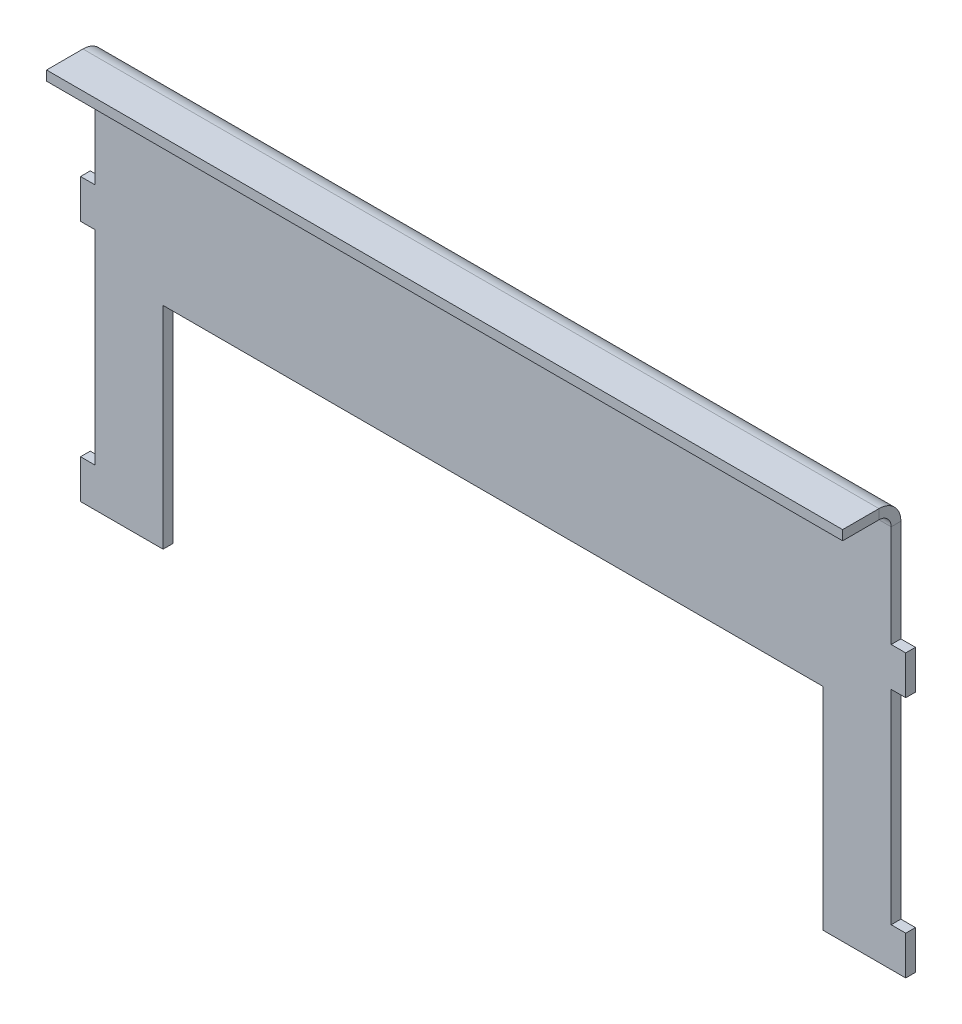
ISO-10303-21;
HEADER;
FILE_DESCRIPTION(('STEP AP214'),'2;1');
FILE_NAME('part.step','',(''),(''),'','','');
FILE_SCHEMA(('AUTOMOTIVE_DESIGN { 1 0 10303 214 1 1 1 1 }'));
ENDSEC;
DATA;
#1=APPLICATION_CONTEXT('core data for automotive mechanical design processes');
#2=APPLICATION_PROTOCOL_DEFINITION('international standard','automotive_design',2000,#1);
#3=PRODUCT_CONTEXT('',#1,'mechanical');
#4=PRODUCT('Part','Part','',(#3));
#5=PRODUCT_RELATED_PRODUCT_CATEGORY('part','',(#4));
#6=PRODUCT_DEFINITION_FORMATION('','',#4);
#7=PRODUCT_DEFINITION_CONTEXT('part definition',#1,'design');
#8=PRODUCT_DEFINITION('design','',#6,#7);
#9=PRODUCT_DEFINITION_SHAPE('','',#8);
#10=(LENGTH_UNIT() NAMED_UNIT(*) SI_UNIT(.MILLI.,.METRE.));
#11=(NAMED_UNIT(*) PLANE_ANGLE_UNIT() SI_UNIT($,.RADIAN.));
#12=(NAMED_UNIT(*) SI_UNIT($,.STERADIAN.) SOLID_ANGLE_UNIT());
#13=UNCERTAINTY_MEASURE_WITH_UNIT(LENGTH_MEASURE(1.E-05),#10,'distance_accuracy_value','');
#14=(GEOMETRIC_REPRESENTATION_CONTEXT(3) GLOBAL_UNCERTAINTY_ASSIGNED_CONTEXT((#13)) GLOBAL_UNIT_ASSIGNED_CONTEXT((#10,
#11,#12)) REPRESENTATION_CONTEXT('',''));
#15=CARTESIAN_POINT('',(0.,0.,0.));
#16=DIRECTION('',(0.,0.,1.));
#17=DIRECTION('',(1.,0.,0.));
#18=AXIS2_PLACEMENT_3D('',#15,#16,#17);
#19=CARTESIAN_POINT('',(-260.35,127.,-6.35));
#20=DIRECTION('',(-1.,0.,0.));
#21=DIRECTION('',(0.,0.,1.));
#22=AXIS2_PLACEMENT_3D('',#19,#20,#21);
#23=PLANE('',#22);
#24=DIRECTION('',(0.,-1.,0.));
#25=VECTOR('',#24,1.);
#26=CARTESIAN_POINT('',(-260.35,127.,0.));
#27=LINE('',#26,#25);
#28=CARTESIAN_POINT('',(-260.35,112.6998,0.));
#29=VERTEX_POINT('',#28);
#30=CARTESIAN_POINT('',(-260.35,46.0375,0.));
#31=VERTEX_POINT('',#30);
#32=EDGE_CURVE('E239',#29,#31,#27,.T.);
#33=ORIENTED_EDGE('',*,*,#32,.F.);
#34=DIRECTION('',(0.,0.,-1.));
#35=VECTOR('',#34,1.);
#36=CARTESIAN_POINT('',(-260.35,112.6998,0.));
#37=LINE('',#36,#35);
#38=CARTESIAN_POINT('',(-260.35,112.6998,-6.35));
#39=VERTEX_POINT('',#38);
#40=EDGE_CURVE('E350',#29,#39,#37,.T.);
#41=ORIENTED_EDGE('',*,*,#40,.T.);
#42=DIRECTION('',(0.,-1.,0.));
#43=VECTOR('',#42,1.);
#44=CARTESIAN_POINT('',(-260.35,127.,-6.35));
#45=LINE('',#44,#43);
#46=CARTESIAN_POINT('',(-260.35,46.0375,-6.35));
#47=VERTEX_POINT('',#46);
#48=EDGE_CURVE('E158',#39,#47,#45,.T.);
#49=ORIENTED_EDGE('',*,*,#48,.T.);
#50=DIRECTION('',(0.,0.,1.));
#51=VECTOR('',#50,1.);
#52=CARTESIAN_POINT('',(-260.35,46.0375,-6.35));
#53=LINE('',#52,#51);
#54=EDGE_CURVE('E68',#47,#31,#53,.T.);
#55=ORIENTED_EDGE('',*,*,#54,.T.);
#56=EDGE_LOOP('',(#33,#41,#49,#55));
#57=FACE_BOUND('',#56,.T.);
#58=ADVANCED_FACE('F65',(#57),#23,.T.);
#59=CARTESIAN_POINT('',(0.,0.,-6.35));
#60=DIRECTION('',(0.,0.,-1.));
#61=DIRECTION('',(-1.,0.,0.));
#62=AXIS2_PLACEMENT_3D('',#59,#60,#61);
#63=PLANE('',#62);
#64=ORIENTED_EDGE('',*,*,#48,.F.);
#65=DIRECTION('',(-1.,0.,0.));
#66=VECTOR('',#65,1.);
#67=CARTESIAN_POINT('',(-260.35,112.6998,-6.35));
#68=LINE('',#67,#66);
#69=CARTESIAN_POINT('',(260.35,112.6998,-6.35));
#70=VERTEX_POINT('',#69);
#71=EDGE_CURVE('E791',#39,#70,#68,.F.);
#72=ORIENTED_EDGE('',*,*,#71,.T.);
#73=DIRECTION('',(0.,1.,0.));
#74=VECTOR('',#73,1.);
#75=CARTESIAN_POINT('',(260.35,127.,-6.35));
#76=LINE('',#75,#74);
#77=CARTESIAN_POINT('',(260.35,46.0375,-6.35));
#78=VERTEX_POINT('',#77);
#79=EDGE_CURVE('E237',#78,#70,#76,.T.);
#80=ORIENTED_EDGE('',*,*,#79,.F.);
#81=DIRECTION('',(-1.,0.,0.));
#82=VECTOR('',#81,1.);
#83=CARTESIAN_POINT('',(260.35,46.0375,-6.35));
#84=LINE('',#83,#82);
#85=CARTESIAN_POINT('',(269.875,46.0375,-6.35));
#86=VERTEX_POINT('',#85);
#87=EDGE_CURVE('E227',#86,#78,#84,.T.);
#88=ORIENTED_EDGE('',*,*,#87,.F.);
#89=DIRECTION('',(0.,1.,0.));
#90=VECTOR('',#89,1.);
#91=CARTESIAN_POINT('',(269.875,46.0375,-6.35));
#92=LINE('',#91,#90);
#93=CARTESIAN_POINT('',(269.875,20.6375,-6.35));
#94=VERTEX_POINT('',#93);
#95=EDGE_CURVE('E211',#94,#86,#92,.T.);
#96=ORIENTED_EDGE('',*,*,#95,.F.);
#97=DIRECTION('',(1.,0.,0.));
#98=VECTOR('',#97,1.);
#99=CARTESIAN_POINT('',(260.35,20.6375,-6.35));
#100=LINE('',#99,#98);
#101=CARTESIAN_POINT('',(260.35,20.6375,-6.35));
#102=VERTEX_POINT('',#101);
#103=EDGE_CURVE('E225',#102,#94,#100,.T.);
#104=ORIENTED_EDGE('',*,*,#103,.F.);
#105=DIRECTION('',(0.,1.,0.));
#106=VECTOR('',#105,1.);
#107=CARTESIAN_POINT('',(260.35,20.6375,-6.35));
#108=LINE('',#107,#106);
#109=CARTESIAN_POINT('',(260.35,-112.7125,-6.35));
#110=VERTEX_POINT('',#109);
#111=EDGE_CURVE('E230',#110,#102,#108,.T.);
#112=ORIENTED_EDGE('',*,*,#111,.F.);
#113=DIRECTION('',(-1.,0.,0.));
#114=VECTOR('',#113,1.);
#115=CARTESIAN_POINT('',(260.35,-112.7125,-6.35));
#116=LINE('',#115,#114);
#117=CARTESIAN_POINT('',(269.875,-112.7125,-6.35));
#118=VERTEX_POINT('',#117);
#119=EDGE_CURVE('E232',#118,#110,#116,.T.);
#120=ORIENTED_EDGE('',*,*,#119,.F.);
#121=DIRECTION('',(0.,1.,0.));
#122=VECTOR('',#121,1.);
#123=CARTESIAN_POINT('',(269.875,-138.1125,-6.35));
#124=LINE('',#123,#122);
#125=CARTESIAN_POINT('',(269.875,-138.1125,-6.35));
#126=VERTEX_POINT('',#125);
#127=EDGE_CURVE('E385',#126,#118,#124,.T.);
#128=ORIENTED_EDGE('',*,*,#127,.F.);
#129=DIRECTION('',(1.,0.,0.));
#130=VECTOR('',#129,1.);
#131=CARTESIAN_POINT('',(269.875,-138.1125,-6.35));
#132=LINE('',#131,#130);
#133=CARTESIAN_POINT('',(215.9,-138.1125,-6.35));
#134=VERTEX_POINT('',#133);
#135=EDGE_CURVE('E382',#134,#126,#132,.T.);
#136=ORIENTED_EDGE('',*,*,#135,.F.);
#137=DIRECTION('',(0.,-1.,0.));
#138=VECTOR('',#137,1.);
#139=CARTESIAN_POINT('',(215.9,0.,-6.35));
#140=LINE('',#139,#138);
#141=CARTESIAN_POINT('',(215.9,0.,-6.35));
#142=VERTEX_POINT('',#141);
#143=EDGE_CURVE('E379',#142,#134,#140,.T.);
#144=ORIENTED_EDGE('',*,*,#143,.F.);
#145=DIRECTION('',(1.,0.,0.));
#146=VECTOR('',#145,1.);
#147=CARTESIAN_POINT('',(-215.9,0.,-6.35));
#148=LINE('',#147,#146);
#149=CARTESIAN_POINT('',(-215.9,0.,-6.35));
#150=VERTEX_POINT('',#149);
#151=EDGE_CURVE('E376',#150,#142,#148,.T.);
#152=ORIENTED_EDGE('',*,*,#151,.F.);
#153=DIRECTION('',(0.,1.,0.));
#154=VECTOR('',#153,1.);
#155=CARTESIAN_POINT('',(-215.9,0.,-6.35));
#156=LINE('',#155,#154);
#157=CARTESIAN_POINT('',(-215.9,-138.1125,-6.35));
#158=VERTEX_POINT('',#157);
#159=EDGE_CURVE('E373',#158,#150,#156,.T.);
#160=ORIENTED_EDGE('',*,*,#159,.F.);
#161=DIRECTION('',(1.,0.,0.));
#162=VECTOR('',#161,1.);
#163=CARTESIAN_POINT('',(-269.875,-138.1125,-6.35));
#164=LINE('',#163,#162);
#165=CARTESIAN_POINT('',(-269.875,-138.1125,-6.35));
#166=VERTEX_POINT('',#165);
#167=EDGE_CURVE('E370',#166,#158,#164,.T.);
#168=ORIENTED_EDGE('',*,*,#167,.F.);
#169=DIRECTION('',(0.,-1.,0.));
#170=VECTOR('',#169,1.);
#171=CARTESIAN_POINT('',(-269.875,-138.1125,-6.35));
#172=LINE('',#171,#170);
#173=CARTESIAN_POINT('',(-269.875,-112.7125,-6.35));
#174=VERTEX_POINT('',#173);
#175=EDGE_CURVE('E367',#174,#166,#172,.T.);
#176=ORIENTED_EDGE('',*,*,#175,.F.);
#177=DIRECTION('',(-1.,0.,0.));
#178=VECTOR('',#177,1.);
#179=CARTESIAN_POINT('',(-260.35,-112.7125,-6.35));
#180=LINE('',#179,#178);
#181=CARTESIAN_POINT('',(-260.35,-112.7125,-6.35));
#182=VERTEX_POINT('',#181);
#183=EDGE_CURVE('E364',#182,#174,#180,.T.);
#184=ORIENTED_EDGE('',*,*,#183,.F.);
#185=DIRECTION('',(0.,-1.,0.));
#186=VECTOR('',#185,1.);
#187=CARTESIAN_POINT('',(-260.35,20.6375,-6.35));
#188=LINE('',#187,#186);
#189=CARTESIAN_POINT('',(-260.35,20.6375,-6.35));
#190=VERTEX_POINT('',#189);
#191=EDGE_CURVE('E361',#190,#182,#188,.T.);
#192=ORIENTED_EDGE('',*,*,#191,.F.);
#193=DIRECTION('',(1.,0.,0.));
#194=VECTOR('',#193,1.);
#195=CARTESIAN_POINT('',(-260.35,20.6375,-6.35));
#196=LINE('',#195,#194);
#197=CARTESIAN_POINT('',(-269.875,20.6375,-6.35));
#198=VERTEX_POINT('',#197);
#199=EDGE_CURVE('E358',#198,#190,#196,.T.);
#200=ORIENTED_EDGE('',*,*,#199,.F.);
#201=DIRECTION('',(0.,-1.,0.));
#202=VECTOR('',#201,1.);
#203=CARTESIAN_POINT('',(-269.875,46.0375,-6.35));
#204=LINE('',#203,#202);
#205=CARTESIAN_POINT('',(-269.875,46.0375,-6.35));
#206=VERTEX_POINT('',#205);
#207=EDGE_CURVE('E355',#206,#198,#204,.T.);
#208=ORIENTED_EDGE('',*,*,#207,.F.);
#209=DIRECTION('',(-1.,0.,0.));
#210=VECTOR('',#209,1.);
#211=CARTESIAN_POINT('',(-260.35,46.0375,-6.35));
#212=LINE('',#211,#210);
#213=EDGE_CURVE('E353',#47,#206,#212,.T.);
#214=ORIENTED_EDGE('',*,*,#213,.F.);
#215=EDGE_LOOP('',(#64,#72,#80,#88,#96,#104,#112,#120,#128,#136,#144,#152,#160,#168,#176,#184,
#192,#200,#208,#214));
#216=FACE_BOUND('',#215,.T.);
#217=ADVANCED_FACE('F223',(#216),#63,.T.);
#218=CARTESIAN_POINT('',(0.,0.,0.));
#219=DIRECTION('',(0.,0.,-1.));
#220=DIRECTION('',(-1.,0.,0.));
#221=AXIS2_PLACEMENT_3D('',#218,#219,#220);
#222=PLANE('',#221);
#223=DIRECTION('',(-1.,0.,0.));
#224=VECTOR('',#223,1.);
#225=CARTESIAN_POINT('',(-260.35,112.6998,0.));
#226=LINE('',#225,#224);
#227=CARTESIAN_POINT('',(260.35,112.6998,0.));
#228=VERTEX_POINT('',#227);
#229=EDGE_CURVE('E331',#29,#228,#226,.F.);
#230=ORIENTED_EDGE('',*,*,#229,.F.);
#231=ORIENTED_EDGE('',*,*,#32,.T.);
#232=DIRECTION('',(-1.,0.,0.));
#233=VECTOR('',#232,1.);
#234=CARTESIAN_POINT('',(-260.35,46.0375,0.));
#235=LINE('',#234,#233);
#236=CARTESIAN_POINT('',(-269.875,46.0375,0.));
#237=VERTEX_POINT('',#236);
#238=EDGE_CURVE('E241',#31,#237,#235,.T.);
#239=ORIENTED_EDGE('',*,*,#238,.T.);
#240=DIRECTION('',(0.,-1.,0.));
#241=VECTOR('',#240,1.);
#242=CARTESIAN_POINT('',(-269.875,46.0375,0.));
#243=LINE('',#242,#241);
#244=CARTESIAN_POINT('',(-269.875,20.6375,0.));
#245=VERTEX_POINT('',#244);
#246=EDGE_CURVE('E245',#237,#245,#243,.T.);
#247=ORIENTED_EDGE('',*,*,#246,.T.);
#248=DIRECTION('',(1.,0.,0.));
#249=VECTOR('',#248,1.);
#250=CARTESIAN_POINT('',(-260.35,20.6375,0.));
#251=LINE('',#250,#249);
#252=CARTESIAN_POINT('',(-260.35,20.6375,0.));
#253=VERTEX_POINT('',#252);
#254=EDGE_CURVE('E248',#245,#253,#251,.T.);
#255=ORIENTED_EDGE('',*,*,#254,.T.);
#256=DIRECTION('',(0.,-1.,0.));
#257=VECTOR('',#256,1.);
#258=CARTESIAN_POINT('',(-260.35,20.6375,0.));
#259=LINE('',#258,#257);
#260=CARTESIAN_POINT('',(-260.35,-112.7125,0.));
#261=VERTEX_POINT('',#260);
#262=EDGE_CURVE('E251',#253,#261,#259,.T.);
#263=ORIENTED_EDGE('',*,*,#262,.T.);
#264=DIRECTION('',(-1.,0.,0.));
#265=VECTOR('',#264,1.);
#266=CARTESIAN_POINT('',(-260.35,-112.7125,0.));
#267=LINE('',#266,#265);
#268=CARTESIAN_POINT('',(-269.875,-112.7125,0.));
#269=VERTEX_POINT('',#268);
#270=EDGE_CURVE('E254',#261,#269,#267,.T.);
#271=ORIENTED_EDGE('',*,*,#270,.T.);
#272=DIRECTION('',(0.,-1.,0.));
#273=VECTOR('',#272,1.);
#274=CARTESIAN_POINT('',(-269.875,-138.1125,0.));
#275=LINE('',#274,#273);
#276=CARTESIAN_POINT('',(-269.875,-138.1125,0.));
#277=VERTEX_POINT('',#276);
#278=EDGE_CURVE('E257',#269,#277,#275,.T.);
#279=ORIENTED_EDGE('',*,*,#278,.T.);
#280=DIRECTION('',(1.,0.,0.));
#281=VECTOR('',#280,1.);
#282=CARTESIAN_POINT('',(-269.875,-138.1125,0.));
#283=LINE('',#282,#281);
#284=CARTESIAN_POINT('',(-215.9,-138.1125,0.));
#285=VERTEX_POINT('',#284);
#286=EDGE_CURVE('E260',#277,#285,#283,.T.);
#287=ORIENTED_EDGE('',*,*,#286,.T.);
#288=DIRECTION('',(0.,1.,0.));
#289=VECTOR('',#288,1.);
#290=CARTESIAN_POINT('',(-215.9,0.,0.));
#291=LINE('',#290,#289);
#292=CARTESIAN_POINT('',(-215.9,0.,0.));
#293=VERTEX_POINT('',#292);
#294=EDGE_CURVE('E263',#285,#293,#291,.T.);
#295=ORIENTED_EDGE('',*,*,#294,.T.);
#296=DIRECTION('',(1.,0.,0.));
#297=VECTOR('',#296,1.);
#298=CARTESIAN_POINT('',(-215.9,0.,0.));
#299=LINE('',#298,#297);
#300=CARTESIAN_POINT('',(215.9,0.,0.));
#301=VERTEX_POINT('',#300);
#302=EDGE_CURVE('E266',#293,#301,#299,.T.);
#303=ORIENTED_EDGE('',*,*,#302,.T.);
#304=DIRECTION('',(0.,-1.,0.));
#305=VECTOR('',#304,1.);
#306=CARTESIAN_POINT('',(215.9,0.,0.));
#307=LINE('',#306,#305);
#308=CARTESIAN_POINT('',(215.9,-138.1125,0.));
#309=VERTEX_POINT('',#308);
#310=EDGE_CURVE('E269',#301,#309,#307,.T.);
#311=ORIENTED_EDGE('',*,*,#310,.T.);
#312=DIRECTION('',(1.,0.,0.));
#313=VECTOR('',#312,1.);
#314=CARTESIAN_POINT('',(269.875,-138.1125,0.));
#315=LINE('',#314,#313);
#316=CARTESIAN_POINT('',(269.875,-138.1125,0.));
#317=VERTEX_POINT('',#316);
#318=EDGE_CURVE('E272',#309,#317,#315,.T.);
#319=ORIENTED_EDGE('',*,*,#318,.T.);
#320=DIRECTION('',(0.,1.,0.));
#321=VECTOR('',#320,1.);
#322=CARTESIAN_POINT('',(269.875,-138.1125,0.));
#323=LINE('',#322,#321);
#324=CARTESIAN_POINT('',(269.875,-112.7125,0.));
#325=VERTEX_POINT('',#324);
#326=EDGE_CURVE('E275',#317,#325,#323,.T.);
#327=ORIENTED_EDGE('',*,*,#326,.T.);
#328=DIRECTION('',(-1.,0.,0.));
#329=VECTOR('',#328,1.);
#330=CARTESIAN_POINT('',(260.35,-112.7125,0.));
#331=LINE('',#330,#329);
#332=CARTESIAN_POINT('',(260.35,-112.7125,0.));
#333=VERTEX_POINT('',#332);
#334=EDGE_CURVE('E278',#325,#333,#331,.T.);
#335=ORIENTED_EDGE('',*,*,#334,.T.);
#336=DIRECTION('',(0.,1.,0.));
#337=VECTOR('',#336,1.);
#338=CARTESIAN_POINT('',(260.35,20.6375,0.));
#339=LINE('',#338,#337);
#340=CARTESIAN_POINT('',(260.35,20.6375,0.));
#341=VERTEX_POINT('',#340);
#342=EDGE_CURVE('E281',#333,#341,#339,.T.);
#343=ORIENTED_EDGE('',*,*,#342,.T.);
#344=DIRECTION('',(1.,0.,0.));
#345=VECTOR('',#344,1.);
#346=CARTESIAN_POINT('',(260.35,20.6375,0.));
#347=LINE('',#346,#345);
#348=CARTESIAN_POINT('',(269.875,20.6375,0.));
#349=VERTEX_POINT('',#348);
#350=EDGE_CURVE('E284',#341,#349,#347,.T.);
#351=ORIENTED_EDGE('',*,*,#350,.T.);
#352=DIRECTION('',(0.,1.,0.));
#353=VECTOR('',#352,1.);
#354=CARTESIAN_POINT('',(269.875,46.0375,0.));
#355=LINE('',#354,#353);
#356=CARTESIAN_POINT('',(269.875,46.0375,0.));
#357=VERTEX_POINT('',#356);
#358=EDGE_CURVE('E213',#349,#357,#355,.T.);
#359=ORIENTED_EDGE('',*,*,#358,.T.);
#360=DIRECTION('',(-1.,0.,0.));
#361=VECTOR('',#360,1.);
#362=CARTESIAN_POINT('',(260.35,46.0375,0.));
#363=LINE('',#362,#361);
#364=CARTESIAN_POINT('',(260.35,46.0375,0.));
#365=VERTEX_POINT('',#364);
#366=EDGE_CURVE('E287',#357,#365,#363,.T.);
#367=ORIENTED_EDGE('',*,*,#366,.T.);
#368=DIRECTION('',(0.,1.,0.));
#369=VECTOR('',#368,1.);
#370=CARTESIAN_POINT('',(260.35,127.,0.));
#371=LINE('',#370,#369);
#372=EDGE_CURVE('E290',#365,#228,#371,.T.);
#373=ORIENTED_EDGE('',*,*,#372,.T.);
#374=EDGE_LOOP('',(#230,#231,#239,#247,#255,#263,#271,#279,#287,#295,#303,#311,#319,#327,#335,
#343,#351,#359,#367,#373));
#375=FACE_BOUND('',#374,.T.);
#376=ADVANCED_FACE('F329',(#375),#222,.F.);
#377=CARTESIAN_POINT('',(260.35,127.,-6.35));
#378=DIRECTION('',(1.,0.,0.));
#379=DIRECTION('',(0.,0.,-1.));
#380=AXIS2_PLACEMENT_3D('',#377,#378,#379);
#381=PLANE('',#380);
#382=DIRECTION('',(0.,0.,-1.));
#383=VECTOR('',#382,1.);
#384=CARTESIAN_POINT('',(260.35,112.6998,0.));
#385=LINE('',#384,#383);
#386=EDGE_CURVE('E242',#228,#70,#385,.T.);
#387=ORIENTED_EDGE('',*,*,#386,.F.);
#388=ORIENTED_EDGE('',*,*,#372,.F.);
#389=DIRECTION('',(0.,0.,1.));
#390=VECTOR('',#389,1.);
#391=CARTESIAN_POINT('',(260.35,46.0375,-6.35));
#392=LINE('',#391,#390);
#393=EDGE_CURVE('E13',#78,#365,#392,.T.);
#394=ORIENTED_EDGE('',*,*,#393,.F.);
#395=ORIENTED_EDGE('',*,*,#79,.T.);
#396=EDGE_LOOP('',(#387,#388,#394,#395));
#397=FACE_BOUND('',#396,.T.);
#398=ADVANCED_FACE('F452',(#397),#381,.T.);
#399=CARTESIAN_POINT('',(260.35,46.0375,-6.35));
#400=DIRECTION('',(0.,1.,0.));
#401=DIRECTION('',(0.,0.,1.));
#402=AXIS2_PLACEMENT_3D('',#399,#400,#401);
#403=PLANE('',#402);
#404=ORIENTED_EDGE('',*,*,#366,.F.);
#405=DIRECTION('',(0.,0.,1.));
#406=VECTOR('',#405,1.);
#407=CARTESIAN_POINT('',(269.875,46.0375,-6.35));
#408=LINE('',#407,#406);
#409=EDGE_CURVE('E73',#86,#357,#408,.T.);
#410=ORIENTED_EDGE('',*,*,#409,.F.);
#411=ORIENTED_EDGE('',*,*,#87,.T.);
#412=ORIENTED_EDGE('',*,*,#393,.T.);
#413=EDGE_LOOP('',(#404,#410,#411,#412));
#414=FACE_BOUND('',#413,.T.);
#415=ADVANCED_FACE('F460',(#414),#403,.T.);
#416=CARTESIAN_POINT('',(269.875,46.0375,-6.35));
#417=DIRECTION('',(1.,0.,0.));
#418=DIRECTION('',(0.,0.,-1.));
#419=AXIS2_PLACEMENT_3D('',#416,#417,#418);
#420=PLANE('',#419);
#421=ORIENTED_EDGE('',*,*,#358,.F.);
#422=DIRECTION('',(0.,0.,1.));
#423=VECTOR('',#422,1.);
#424=CARTESIAN_POINT('',(269.875,20.6375,-6.35));
#425=LINE('',#424,#423);
#426=EDGE_CURVE('E208',#94,#349,#425,.T.);
#427=ORIENTED_EDGE('',*,*,#426,.F.);
#428=ORIENTED_EDGE('',*,*,#95,.T.);
#429=ORIENTED_EDGE('',*,*,#409,.T.);
#430=EDGE_LOOP('',(#421,#427,#428,#429));
#431=FACE_BOUND('',#430,.T.);
#432=ADVANCED_FACE('F210',(#431),#420,.T.);
#433=CARTESIAN_POINT('',(260.35,20.6375,-6.35));
#434=DIRECTION('',(0.,-1.,0.));
#435=DIRECTION('',(0.,0.,-1.));
#436=AXIS2_PLACEMENT_3D('',#433,#434,#435);
#437=PLANE('',#436);
#438=ORIENTED_EDGE('',*,*,#350,.F.);
#439=DIRECTION('',(0.,0.,1.));
#440=VECTOR('',#439,1.);
#441=CARTESIAN_POINT('',(260.35,20.6375,-6.35));
#442=LINE('',#441,#440);
#443=EDGE_CURVE('E218',#102,#341,#442,.T.);
#444=ORIENTED_EDGE('',*,*,#443,.F.);
#445=ORIENTED_EDGE('',*,*,#103,.T.);
#446=ORIENTED_EDGE('',*,*,#426,.T.);
#447=EDGE_LOOP('',(#438,#444,#445,#446));
#448=FACE_BOUND('',#447,.T.);
#449=ADVANCED_FACE('F229',(#448),#437,.T.);
#450=CARTESIAN_POINT('',(260.35,20.6375,-6.35));
#451=DIRECTION('',(1.,0.,0.));
#452=DIRECTION('',(0.,0.,-1.));
#453=AXIS2_PLACEMENT_3D('',#450,#451,#452);
#454=PLANE('',#453);
#455=ORIENTED_EDGE('',*,*,#342,.F.);
#456=DIRECTION('',(0.,0.,1.));
#457=VECTOR('',#456,1.);
#458=CARTESIAN_POINT('',(260.35,-112.7125,-6.35));
#459=LINE('',#458,#457);
#460=EDGE_CURVE('E295',#110,#333,#459,.T.);
#461=ORIENTED_EDGE('',*,*,#460,.F.);
#462=ORIENTED_EDGE('',*,*,#111,.T.);
#463=ORIENTED_EDGE('',*,*,#443,.T.);
#464=EDGE_LOOP('',(#455,#461,#462,#463));
#465=FACE_BOUND('',#464,.T.);
#466=ADVANCED_FACE('F467',(#465),#454,.T.);
#467=CARTESIAN_POINT('',(260.35,-112.7125,-6.35));
#468=DIRECTION('',(0.,1.,0.));
#469=DIRECTION('',(0.,0.,1.));
#470=AXIS2_PLACEMENT_3D('',#467,#468,#469);
#471=PLANE('',#470);
#472=ORIENTED_EDGE('',*,*,#334,.F.);
#473=DIRECTION('',(0.,0.,1.));
#474=VECTOR('',#473,1.);
#475=CARTESIAN_POINT('',(269.875,-112.7125,-6.35));
#476=LINE('',#475,#474);
#477=EDGE_CURVE('E297',#118,#325,#476,.T.);
#478=ORIENTED_EDGE('',*,*,#477,.F.);
#479=ORIENTED_EDGE('',*,*,#119,.T.);
#480=ORIENTED_EDGE('',*,*,#460,.T.);
#481=EDGE_LOOP('',(#472,#478,#479,#480));
#482=FACE_BOUND('',#481,.T.);
#483=ADVANCED_FACE('F391',(#482),#471,.T.);
#484=CARTESIAN_POINT('',(269.875,-138.1125,-6.35));
#485=DIRECTION('',(1.,0.,0.));
#486=DIRECTION('',(0.,0.,-1.));
#487=AXIS2_PLACEMENT_3D('',#484,#485,#486);
#488=PLANE('',#487);
#489=ORIENTED_EDGE('',*,*,#326,.F.);
#490=DIRECTION('',(0.,0.,1.));
#491=VECTOR('',#490,1.);
#492=CARTESIAN_POINT('',(269.875,-138.1125,-6.35));
#493=LINE('',#492,#491);
#494=EDGE_CURVE('E299',#126,#317,#493,.T.);
#495=ORIENTED_EDGE('',*,*,#494,.F.);
#496=ORIENTED_EDGE('',*,*,#127,.T.);
#497=ORIENTED_EDGE('',*,*,#477,.T.);
#498=EDGE_LOOP('',(#489,#495,#496,#497));
#499=FACE_BOUND('',#498,.T.);
#500=ADVANCED_FACE('F397',(#499),#488,.T.);
#501=CARTESIAN_POINT('',(269.875,-138.1125,-6.35));
#502=DIRECTION('',(0.,-1.,0.));
#503=DIRECTION('',(0.,0.,-1.));
#504=AXIS2_PLACEMENT_3D('',#501,#502,#503);
#505=PLANE('',#504);
#506=ORIENTED_EDGE('',*,*,#318,.F.);
#507=DIRECTION('',(0.,0.,1.));
#508=VECTOR('',#507,1.);
#509=CARTESIAN_POINT('',(215.9,-138.1125,-6.35));
#510=LINE('',#509,#508);
#511=EDGE_CURVE('E301',#134,#309,#510,.T.);
#512=ORIENTED_EDGE('',*,*,#511,.F.);
#513=ORIENTED_EDGE('',*,*,#135,.T.);
#514=ORIENTED_EDGE('',*,*,#494,.T.);
#515=EDGE_LOOP('',(#506,#512,#513,#514));
#516=FACE_BOUND('',#515,.T.);
#517=ADVANCED_FACE('F400',(#516),#505,.T.);
#518=CARTESIAN_POINT('',(215.9,0.,-6.35));
#519=DIRECTION('',(-1.,0.,0.));
#520=DIRECTION('',(0.,-1.,0.));
#521=AXIS2_PLACEMENT_3D('',#518,#519,#520);
#522=PLANE('',#521);
#523=ORIENTED_EDGE('',*,*,#310,.F.);
#524=DIRECTION('',(0.,0.,1.));
#525=VECTOR('',#524,1.);
#526=CARTESIAN_POINT('',(215.9,0.,-6.35));
#527=LINE('',#526,#525);
#528=EDGE_CURVE('E303',#142,#301,#527,.T.);
#529=ORIENTED_EDGE('',*,*,#528,.F.);
#530=ORIENTED_EDGE('',*,*,#143,.T.);
#531=ORIENTED_EDGE('',*,*,#511,.T.);
#532=EDGE_LOOP('',(#523,#529,#530,#531));
#533=FACE_BOUND('',#532,.T.);
#534=ADVANCED_FACE('F405',(#533),#522,.T.);
#535=CARTESIAN_POINT('',(-215.9,0.,-6.35));
#536=DIRECTION('',(0.,-1.,0.));
#537=DIRECTION('',(0.,0.,-1.));
#538=AXIS2_PLACEMENT_3D('',#535,#536,#537);
#539=PLANE('',#538);
#540=ORIENTED_EDGE('',*,*,#302,.F.);
#541=DIRECTION('',(0.,0.,1.));
#542=VECTOR('',#541,1.);
#543=CARTESIAN_POINT('',(-215.9,0.,-6.35));
#544=LINE('',#543,#542);
#545=EDGE_CURVE('E305',#150,#293,#544,.T.);
#546=ORIENTED_EDGE('',*,*,#545,.F.);
#547=ORIENTED_EDGE('',*,*,#151,.T.);
#548=ORIENTED_EDGE('',*,*,#528,.T.);
#549=EDGE_LOOP('',(#540,#546,#547,#548));
#550=FACE_BOUND('',#549,.T.);
#551=ADVANCED_FACE('F408',(#550),#539,.T.);
#552=CARTESIAN_POINT('',(-215.9,0.,-6.35));
#553=DIRECTION('',(1.,0.,0.));
#554=DIRECTION('',(0.,1.,0.));
#555=AXIS2_PLACEMENT_3D('',#552,#553,#554);
#556=PLANE('',#555);
#557=ORIENTED_EDGE('',*,*,#294,.F.);
#558=DIRECTION('',(0.,0.,1.));
#559=VECTOR('',#558,1.);
#560=CARTESIAN_POINT('',(-215.9,-138.1125,-6.35));
#561=LINE('',#560,#559);
#562=EDGE_CURVE('E307',#158,#285,#561,.T.);
#563=ORIENTED_EDGE('',*,*,#562,.F.);
#564=ORIENTED_EDGE('',*,*,#159,.T.);
#565=ORIENTED_EDGE('',*,*,#545,.T.);
#566=EDGE_LOOP('',(#557,#563,#564,#565));
#567=FACE_BOUND('',#566,.T.);
#568=ADVANCED_FACE('F413',(#567),#556,.T.);
#569=CARTESIAN_POINT('',(-269.875,-138.1125,-6.35));
#570=DIRECTION('',(0.,-1.,0.));
#571=DIRECTION('',(0.,0.,-1.));
#572=AXIS2_PLACEMENT_3D('',#569,#570,#571);
#573=PLANE('',#572);
#574=ORIENTED_EDGE('',*,*,#286,.F.);
#575=DIRECTION('',(0.,0.,1.));
#576=VECTOR('',#575,1.);
#577=CARTESIAN_POINT('',(-269.875,-138.1125,-6.35));
#578=LINE('',#577,#576);
#579=EDGE_CURVE('E309',#166,#277,#578,.T.);
#580=ORIENTED_EDGE('',*,*,#579,.F.);
#581=ORIENTED_EDGE('',*,*,#167,.T.);
#582=ORIENTED_EDGE('',*,*,#562,.T.);
#583=EDGE_LOOP('',(#574,#580,#581,#582));
#584=FACE_BOUND('',#583,.T.);
#585=ADVANCED_FACE('F416',(#584),#573,.T.);
#586=CARTESIAN_POINT('',(-269.875,-138.1125,-6.35));
#587=DIRECTION('',(-1.,0.,0.));
#588=DIRECTION('',(0.,0.,1.));
#589=AXIS2_PLACEMENT_3D('',#586,#587,#588);
#590=PLANE('',#589);
#591=ORIENTED_EDGE('',*,*,#278,.F.);
#592=DIRECTION('',(0.,0.,1.));
#593=VECTOR('',#592,1.);
#594=CARTESIAN_POINT('',(-269.875,-112.7125,-6.35));
#595=LINE('',#594,#593);
#596=EDGE_CURVE('E311',#174,#269,#595,.T.);
#597=ORIENTED_EDGE('',*,*,#596,.F.);
#598=ORIENTED_EDGE('',*,*,#175,.T.);
#599=ORIENTED_EDGE('',*,*,#579,.T.);
#600=EDGE_LOOP('',(#591,#597,#598,#599));
#601=FACE_BOUND('',#600,.T.);
#602=ADVANCED_FACE('F421',(#601),#590,.T.);
#603=CARTESIAN_POINT('',(-260.35,-112.7125,-6.35));
#604=DIRECTION('',(0.,1.,0.));
#605=DIRECTION('',(0.,0.,1.));
#606=AXIS2_PLACEMENT_3D('',#603,#604,#605);
#607=PLANE('',#606);
#608=ORIENTED_EDGE('',*,*,#270,.F.);
#609=DIRECTION('',(0.,0.,1.));
#610=VECTOR('',#609,1.);
#611=CARTESIAN_POINT('',(-260.35,-112.7125,-6.35));
#612=LINE('',#611,#610);
#613=EDGE_CURVE('E313',#182,#261,#612,.T.);
#614=ORIENTED_EDGE('',*,*,#613,.F.);
#615=ORIENTED_EDGE('',*,*,#183,.T.);
#616=ORIENTED_EDGE('',*,*,#596,.T.);
#617=EDGE_LOOP('',(#608,#614,#615,#616));
#618=FACE_BOUND('',#617,.T.);
#619=ADVANCED_FACE('F424',(#618),#607,.T.);
#620=CARTESIAN_POINT('',(-260.35,20.6375,-6.35));
#621=DIRECTION('',(-1.,0.,0.));
#622=DIRECTION('',(0.,0.,1.));
#623=AXIS2_PLACEMENT_3D('',#620,#621,#622);
#624=PLANE('',#623);
#625=ORIENTED_EDGE('',*,*,#262,.F.);
#626=DIRECTION('',(0.,0.,1.));
#627=VECTOR('',#626,1.);
#628=CARTESIAN_POINT('',(-260.35,20.6375,-6.35));
#629=LINE('',#628,#627);
#630=EDGE_CURVE('E315',#190,#253,#629,.T.);
#631=ORIENTED_EDGE('',*,*,#630,.F.);
#632=ORIENTED_EDGE('',*,*,#191,.T.);
#633=ORIENTED_EDGE('',*,*,#613,.T.);
#634=EDGE_LOOP('',(#625,#631,#632,#633));
#635=FACE_BOUND('',#634,.T.);
#636=ADVANCED_FACE('F429',(#635),#624,.T.);
#637=CARTESIAN_POINT('',(-260.35,20.6375,-6.35));
#638=DIRECTION('',(0.,-1.,0.));
#639=DIRECTION('',(0.,0.,-1.));
#640=AXIS2_PLACEMENT_3D('',#637,#638,#639);
#641=PLANE('',#640);
#642=ORIENTED_EDGE('',*,*,#254,.F.);
#643=DIRECTION('',(0.,0.,1.));
#644=VECTOR('',#643,1.);
#645=CARTESIAN_POINT('',(-269.875,20.6375,-6.35));
#646=LINE('',#645,#644);
#647=EDGE_CURVE('E317',#198,#245,#646,.T.);
#648=ORIENTED_EDGE('',*,*,#647,.F.);
#649=ORIENTED_EDGE('',*,*,#199,.T.);
#650=ORIENTED_EDGE('',*,*,#630,.T.);
#651=EDGE_LOOP('',(#642,#648,#649,#650));
#652=FACE_BOUND('',#651,.T.);
#653=ADVANCED_FACE('F432',(#652),#641,.T.);
#654=CARTESIAN_POINT('',(-269.875,46.0375,-6.35));
#655=DIRECTION('',(-1.,0.,0.));
#656=DIRECTION('',(0.,0.,1.));
#657=AXIS2_PLACEMENT_3D('',#654,#655,#656);
#658=PLANE('',#657);
#659=ORIENTED_EDGE('',*,*,#246,.F.);
#660=DIRECTION('',(0.,0.,1.));
#661=VECTOR('',#660,1.);
#662=CARTESIAN_POINT('',(-269.875,46.0375,-6.35));
#663=LINE('',#662,#661);
#664=EDGE_CURVE('E318',#206,#237,#663,.T.);
#665=ORIENTED_EDGE('',*,*,#664,.F.);
#666=ORIENTED_EDGE('',*,*,#207,.T.);
#667=ORIENTED_EDGE('',*,*,#647,.T.);
#668=EDGE_LOOP('',(#659,#665,#666,#667));
#669=FACE_BOUND('',#668,.T.);
#670=ADVANCED_FACE('F435',(#669),#658,.T.);
#671=CARTESIAN_POINT('',(-260.35,46.0375,-6.35));
#672=DIRECTION('',(0.,1.,0.));
#673=DIRECTION('',(0.,0.,1.));
#674=AXIS2_PLACEMENT_3D('',#671,#672,#673);
#675=PLANE('',#674);
#676=ORIENTED_EDGE('',*,*,#238,.F.);
#677=ORIENTED_EDGE('',*,*,#54,.F.);
#678=ORIENTED_EDGE('',*,*,#213,.T.);
#679=ORIENTED_EDGE('',*,*,#664,.T.);
#680=EDGE_LOOP('',(#676,#677,#678,#679));
#681=FACE_BOUND('',#680,.T.);
#682=ADVANCED_FACE('F326',(#681),#675,.T.);
#683=CARTESIAN_POINT('',(260.35,112.6998,7.9502));
#684=DIRECTION('',(1.,0.,0.));
#685=DIRECTION('',(0.,0.,-1.));
#686=AXIS2_PLACEMENT_3D('',#683,#684,#685);
#687=PLANE('',#686);
#688=DIRECTION('',(0.,1.,0.));
#689=VECTOR('',#688,1.);
#690=CARTESIAN_POINT('',(260.35,127.,7.95019999999996));
#691=LINE('',#690,#689);
#692=CARTESIAN_POINT('',(260.35,120.65,7.95019999999998));
#693=VERTEX_POINT('',#692);
#694=CARTESIAN_POINT('',(260.35,127.,7.95019999999995));
#695=VERTEX_POINT('',#694);
#696=EDGE_CURVE('E788',#693,#695,#691,.T.);
#697=ORIENTED_EDGE('',*,*,#696,.F.);
#698=CARTESIAN_POINT('',(260.35,112.6998,7.9502));
#699=DIRECTION('',(-1.,0.,0.));
#700=DIRECTION('',(0.,0.,1.));
#701=AXIS2_PLACEMENT_3D('',#698,#699,#700);
#702=CIRCLE('',#701,7.9502);
#703=EDGE_CURVE('E340',#228,#693,#702,.F.);
#704=ORIENTED_EDGE('',*,*,#703,.F.);
#705=ORIENTED_EDGE('',*,*,#386,.T.);
#706=CARTESIAN_POINT('',(260.35,112.6998,7.9502));
#707=DIRECTION('',(-1.,0.,0.));
#708=DIRECTION('',(0.,0.,1.));
#709=AXIS2_PLACEMENT_3D('',#706,#707,#708);
#710=CIRCLE('',#709,14.3002);
#711=EDGE_CURVE('E81',#70,#695,#710,.F.);
#712=ORIENTED_EDGE('',*,*,#711,.T.);
#713=EDGE_LOOP('',(#697,#704,#705,#712));
#714=FACE_BOUND('',#713,.T.);
#715=ADVANCED_FACE('F442',(#714),#687,.T.);
#716=CARTESIAN_POINT('',(-260.35,112.6998,7.9502));
#717=DIRECTION('',(1.,0.,0.));
#718=DIRECTION('',(0.,0.,-1.));
#719=AXIS2_PLACEMENT_3D('',#716,#717,#718);
#720=PLANE('',#719);
#721=CARTESIAN_POINT('',(-260.35,112.6998,7.9502));
#722=DIRECTION('',(-1.,0.,0.));
#723=DIRECTION('',(0.,0.,1.));
#724=AXIS2_PLACEMENT_3D('',#721,#722,#723);
#725=CIRCLE('',#724,7.9502);
#726=CARTESIAN_POINT('',(-260.35,120.65,7.95019999999998));
#727=VERTEX_POINT('',#726);
#728=EDGE_CURVE('E341',#727,#29,#725,.T.);
#729=ORIENTED_EDGE('',*,*,#728,.F.);
#730=DIRECTION('',(0.,1.,0.));
#731=VECTOR('',#730,1.);
#732=CARTESIAN_POINT('',(-260.35,120.65,7.95019999999998));
#733=LINE('',#732,#731);
#734=CARTESIAN_POINT('',(-260.35,127.,7.95019999999995));
#735=VERTEX_POINT('',#734);
#736=EDGE_CURVE('E782',#727,#735,#733,.T.);
#737=ORIENTED_EDGE('',*,*,#736,.T.);
#738=CARTESIAN_POINT('',(-260.35,112.6998,7.9502));
#739=DIRECTION('',(-1.,0.,0.));
#740=DIRECTION('',(0.,0.,1.));
#741=AXIS2_PLACEMENT_3D('',#738,#739,#740);
#742=CIRCLE('',#741,14.3002);
#743=EDGE_CURVE('E343',#735,#39,#742,.T.);
#744=ORIENTED_EDGE('',*,*,#743,.T.);
#745=ORIENTED_EDGE('',*,*,#40,.F.);
#746=EDGE_LOOP('',(#729,#737,#744,#745));
#747=FACE_BOUND('',#746,.T.);
#748=ADVANCED_FACE('F455',(#747),#720,.F.);
#749=CARTESIAN_POINT('',(-260.35,112.6998,7.9502));
#750=DIRECTION('',(-1.,0.,0.));
#751=DIRECTION('',(0.,1.,0.));
#752=AXIS2_PLACEMENT_3D('',#749,#750,#751);
#753=CYLINDRICAL_SURFACE('',#752,14.3002);
#754=ORIENTED_EDGE('',*,*,#71,.F.);
#755=ORIENTED_EDGE('',*,*,#743,.F.);
#756=DIRECTION('',(-1.,0.,0.));
#757=VECTOR('',#756,1.);
#758=CARTESIAN_POINT('',(0.,127.,7.95019999999995));
#759=LINE('',#758,#757);
#760=EDGE_CURVE('E776',#695,#735,#759,.T.);
#761=ORIENTED_EDGE('',*,*,#760,.F.);
#762=ORIENTED_EDGE('',*,*,#711,.F.);
#763=EDGE_LOOP('',(#754,#755,#761,#762));
#764=FACE_BOUND('',#763,.T.);
#765=ADVANCED_FACE('F547',(#764),#753,.T.);
#766=CARTESIAN_POINT('',(-260.35,112.6998,7.9502));
#767=DIRECTION('',(-1.,0.,0.));
#768=DIRECTION('',(0.,1.,0.));
#769=AXIS2_PLACEMENT_3D('',#766,#767,#768);
#770=CYLINDRICAL_SURFACE('',#769,7.9502);
#771=ORIENTED_EDGE('',*,*,#229,.T.);
#772=ORIENTED_EDGE('',*,*,#703,.T.);
#773=DIRECTION('',(1.,0.,0.));
#774=VECTOR('',#773,1.);
#775=CARTESIAN_POINT('',(260.35,120.65,7.95019999999998));
#776=LINE('',#775,#774);
#777=EDGE_CURVE('E785',#693,#727,#776,.F.);
#778=ORIENTED_EDGE('',*,*,#777,.T.);
#779=ORIENTED_EDGE('',*,*,#728,.T.);
#780=EDGE_LOOP('',(#771,#772,#778,#779));
#781=FACE_BOUND('',#780,.T.);
#782=ADVANCED_FACE('F557',(#781),#770,.F.);
#783=CARTESIAN_POINT('',(-260.35,127.,0.));
#784=DIRECTION('',(-1.,0.,0.));
#785=DIRECTION('',(0.,0.,1.));
#786=AXIS2_PLACEMENT_3D('',#783,#784,#785);
#787=PLANE('',#786);
#788=DIRECTION('',(0.,0.,-1.));
#789=VECTOR('',#788,1.);
#790=CARTESIAN_POINT('',(-260.35,127.,0.));
#791=LINE('',#790,#789);
#792=CARTESIAN_POINT('',(-260.35,127.,31.75));
#793=VERTEX_POINT('',#792);
#794=EDGE_CURVE('E808',#793,#735,#791,.T.);
#795=ORIENTED_EDGE('',*,*,#794,.T.);
#796=ORIENTED_EDGE('',*,*,#736,.F.);
#797=DIRECTION('',(0.,0.,1.));
#798=VECTOR('',#797,1.);
#799=CARTESIAN_POINT('',(-260.35,120.65,-8.99280649946376E-13));
#800=LINE('',#799,#798);
#801=CARTESIAN_POINT('',(-260.35,120.65,31.75));
#802=VERTEX_POINT('',#801);
#803=EDGE_CURVE('E771',#802,#727,#800,.F.);
#804=ORIENTED_EDGE('',*,*,#803,.F.);
#805=DIRECTION('',(0.,-1.,0.));
#806=VECTOR('',#805,1.);
#807=CARTESIAN_POINT('',(-260.35,127.,31.75));
#808=LINE('',#807,#806);
#809=EDGE_CURVE('E345',#793,#802,#808,.T.);
#810=ORIENTED_EDGE('',*,*,#809,.F.);
#811=EDGE_LOOP('',(#795,#796,#804,#810));
#812=FACE_BOUND('',#811,.T.);
#813=ADVANCED_FACE('F567',(#812),#787,.T.);
#814=CARTESIAN_POINT('',(260.35,127.,31.75));
#815=DIRECTION('',(1.,0.,0.));
#816=DIRECTION('',(0.,0.,-1.));
#817=AXIS2_PLACEMENT_3D('',#814,#815,#816);
#818=PLANE('',#817);
#819=DIRECTION('',(0.,0.,-1.));
#820=VECTOR('',#819,1.);
#821=CARTESIAN_POINT('',(260.35,120.65,-8.99280649946376E-13));
#822=LINE('',#821,#820);
#823=CARTESIAN_POINT('',(260.35,120.65,31.75));
#824=VERTEX_POINT('',#823);
#825=EDGE_CURVE('E772',#693,#824,#822,.F.);
#826=ORIENTED_EDGE('',*,*,#825,.F.);
#827=ORIENTED_EDGE('',*,*,#696,.T.);
#828=DIRECTION('',(0.,0.,1.));
#829=VECTOR('',#828,1.);
#830=CARTESIAN_POINT('',(260.35,127.,31.75));
#831=LINE('',#830,#829);
#832=CARTESIAN_POINT('',(260.35,127.,31.75));
#833=VERTEX_POINT('',#832);
#834=EDGE_CURVE('E774',#695,#833,#831,.T.);
#835=ORIENTED_EDGE('',*,*,#834,.T.);
#836=DIRECTION('',(0.,-1.,0.));
#837=VECTOR('',#836,1.);
#838=CARTESIAN_POINT('',(260.35,127.,31.75));
#839=LINE('',#838,#837);
#840=EDGE_CURVE('E763',#833,#824,#839,.T.);
#841=ORIENTED_EDGE('',*,*,#840,.T.);
#842=EDGE_LOOP('',(#826,#827,#835,#841));
#843=FACE_BOUND('',#842,.T.);
#844=ADVANCED_FACE('F577',(#843),#818,.T.);
#845=CARTESIAN_POINT('',(0.,127.,-4.66260116351716E-13));
#846=DIRECTION('',(0.,1.,0.));
#847=DIRECTION('',(0.,0.,1.));
#848=AXIS2_PLACEMENT_3D('',#845,#846,#847);
#849=PLANE('',#848);
#850=ORIENTED_EDGE('',*,*,#834,.F.);
#851=ORIENTED_EDGE('',*,*,#760,.T.);
#852=ORIENTED_EDGE('',*,*,#794,.F.);
#853=DIRECTION('',(-1.,0.,0.));
#854=VECTOR('',#853,1.);
#855=CARTESIAN_POINT('',(-260.35,127.,31.75));
#856=LINE('',#855,#854);
#857=EDGE_CURVE('E812',#833,#793,#856,.T.);
#858=ORIENTED_EDGE('',*,*,#857,.F.);
#859=EDGE_LOOP('',(#850,#851,#852,#858));
#860=FACE_BOUND('',#859,.T.);
#861=ADVANCED_FACE('F588',(#860),#849,.T.);
#862=CARTESIAN_POINT('',(0.,120.65,-4.44089209850062E-13));
#863=DIRECTION('',(0.,1.,0.));
#864=DIRECTION('',(0.,0.,1.));
#865=AXIS2_PLACEMENT_3D('',#862,#863,#864);
#866=PLANE('',#865);
#867=ORIENTED_EDGE('',*,*,#777,.F.);
#868=ORIENTED_EDGE('',*,*,#825,.T.);
#869=DIRECTION('',(1.,0.,0.));
#870=VECTOR('',#869,1.);
#871=CARTESIAN_POINT('',(0.,120.65,31.75));
#872=LINE('',#871,#870);
#873=EDGE_CURVE('E759',#824,#802,#872,.F.);
#874=ORIENTED_EDGE('',*,*,#873,.T.);
#875=ORIENTED_EDGE('',*,*,#803,.T.);
#876=EDGE_LOOP('',(#867,#868,#874,#875));
#877=FACE_BOUND('',#876,.T.);
#878=ADVANCED_FACE('F599',(#877),#866,.F.);
#879=CARTESIAN_POINT('',(-260.35,127.,31.75));
#880=DIRECTION('',(0.,0.,1.));
#881=DIRECTION('',(0.,-1.,0.));
#882=AXIS2_PLACEMENT_3D('',#879,#880,#881);
#883=PLANE('',#882);
#884=ORIENTED_EDGE('',*,*,#873,.F.);
#885=ORIENTED_EDGE('',*,*,#840,.F.);
#886=ORIENTED_EDGE('',*,*,#857,.T.);
#887=ORIENTED_EDGE('',*,*,#809,.T.);
#888=EDGE_LOOP('',(#884,#885,#886,#887));
#889=FACE_BOUND('',#888,.T.);
#890=ADVANCED_FACE('F610',(#889),#883,.T.);
#891=CLOSED_SHELL('',(#58,#217,#376,#398,#415,#432,#449,#466,#483,#500,#517,#534,#551,#568,#585,
#602,#619,#636,#653,#670,#682,#715,#748,#765,#782,#813,#844,#861,#878,#890));
#892=MANIFOLD_SOLID_BREP('B2',#891);
#893=ADVANCED_BREP_SHAPE_REPRESENTATION('',(#18,#892),#14);
#894=SHAPE_DEFINITION_REPRESENTATION(#9,#893);
ENDSEC;
END-ISO-10303-21;
